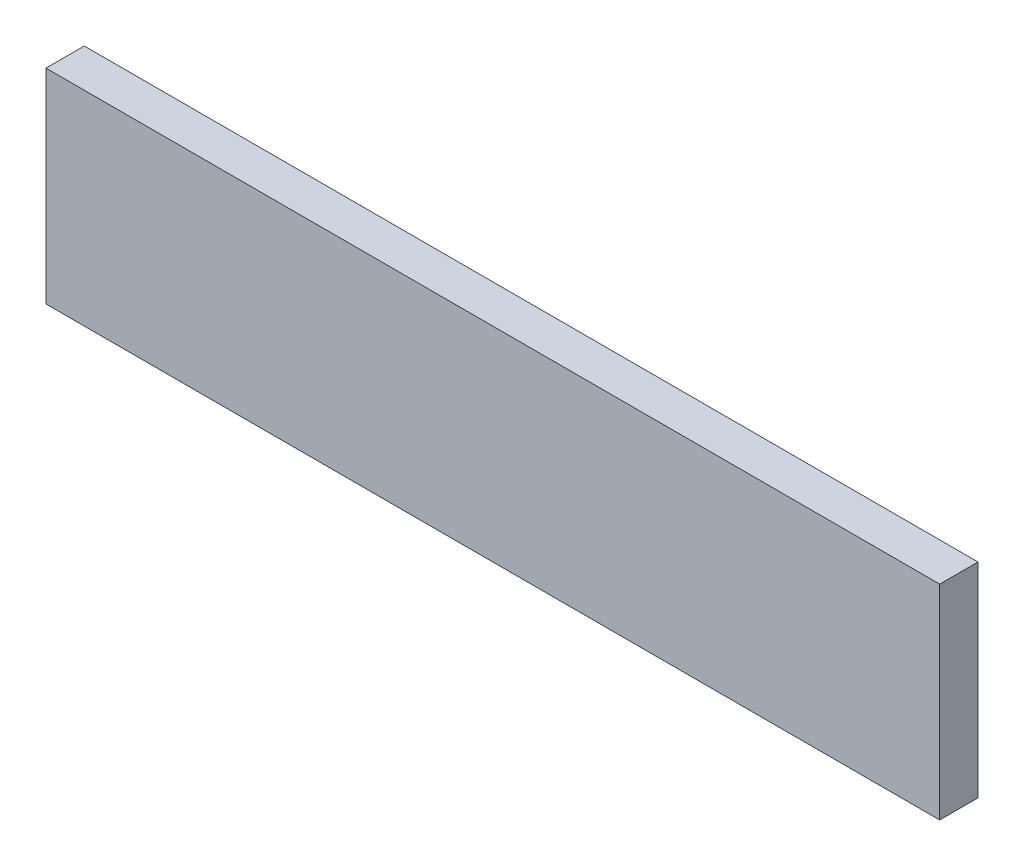
ISO-10303-21;
HEADER;
FILE_DESCRIPTION(('STEP AP214'),'2;1');
FILE_NAME('part.step','',(''),(''),'','','');
FILE_SCHEMA(('AUTOMOTIVE_DESIGN { 1 0 10303 214 1 1 1 1 }'));
ENDSEC;
DATA;
#1=APPLICATION_CONTEXT('core data for automotive mechanical design processes');
#2=APPLICATION_PROTOCOL_DEFINITION('international standard','automotive_design',2000,#1);
#3=PRODUCT_CONTEXT('',#1,'mechanical');
#4=PRODUCT('Part','Part','',(#3));
#5=PRODUCT_RELATED_PRODUCT_CATEGORY('part','',(#4));
#6=PRODUCT_DEFINITION_FORMATION('','',#4);
#7=PRODUCT_DEFINITION_CONTEXT('part definition',#1,'design');
#8=PRODUCT_DEFINITION('design','',#6,#7);
#9=PRODUCT_DEFINITION_SHAPE('','',#8);
#10=(LENGTH_UNIT() NAMED_UNIT(*) SI_UNIT(.MILLI.,.METRE.));
#11=(NAMED_UNIT(*) PLANE_ANGLE_UNIT() SI_UNIT($,.RADIAN.));
#12=(NAMED_UNIT(*) SI_UNIT($,.STERADIAN.) SOLID_ANGLE_UNIT());
#13=UNCERTAINTY_MEASURE_WITH_UNIT(LENGTH_MEASURE(1.E-05),#10,'distance_accuracy_value','');
#14=(GEOMETRIC_REPRESENTATION_CONTEXT(3) GLOBAL_UNCERTAINTY_ASSIGNED_CONTEXT((#13)) GLOBAL_UNIT_ASSIGNED_CONTEXT((#10,
#11,#12)) REPRESENTATION_CONTEXT('',''));
#15=CARTESIAN_POINT('',(0.,0.,0.));
#16=DIRECTION('',(0.,0.,1.));
#17=DIRECTION('',(1.,0.,0.));
#18=AXIS2_PLACEMENT_3D('',#15,#16,#17);
#19=CARTESIAN_POINT('',(0.,0.,-15.));
#20=DIRECTION('',(-1.,0.,0.));
#21=DIRECTION('',(0.,-1.,0.));
#22=AXIS2_PLACEMENT_3D('',#19,#20,#21);
#23=PLANE('',#22);
#24=DIRECTION('',(0.,-1.,0.));
#25=VECTOR('',#24,1.);
#26=CARTESIAN_POINT('',(0.,0.,0.));
#27=LINE('',#26,#25);
#28=CARTESIAN_POINT('',(0.,0.,0.));
#29=VERTEX_POINT('',#28);
#30=CARTESIAN_POINT('',(0.,-80.,0.));
#31=VERTEX_POINT('',#30);
#32=EDGE_CURVE('E102',#29,#31,#27,.T.);
#33=ORIENTED_EDGE('',*,*,#32,.F.);
#34=DIRECTION('',(0.,0.,1.));
#35=VECTOR('',#34,1.);
#36=CARTESIAN_POINT('',(0.,0.,-15.));
#37=LINE('',#36,#35);
#38=CARTESIAN_POINT('',(0.,0.,-15.));
#39=VERTEX_POINT('',#38);
#40=EDGE_CURVE('E11',#39,#29,#37,.T.);
#41=ORIENTED_EDGE('',*,*,#40,.F.);
#42=DIRECTION('',(0.,-1.,0.));
#43=VECTOR('',#42,1.);
#44=CARTESIAN_POINT('',(0.,0.,-15.));
#45=LINE('',#44,#43);
#46=CARTESIAN_POINT('',(0.,-80.,-15.));
#47=VERTEX_POINT('',#46);
#48=EDGE_CURVE('E96',#39,#47,#45,.T.);
#49=ORIENTED_EDGE('',*,*,#48,.T.);
#50=DIRECTION('',(0.,0.,1.));
#51=VECTOR('',#50,1.);
#52=CARTESIAN_POINT('',(0.,-80.,-15.));
#53=LINE('',#52,#51);
#54=EDGE_CURVE('E41',#47,#31,#53,.T.);
#55=ORIENTED_EDGE('',*,*,#54,.T.);
#56=EDGE_LOOP('',(#33,#41,#49,#55));
#57=FACE_BOUND('',#56,.T.);
#58=ADVANCED_FACE('F38',(#57),#23,.T.);
#59=CARTESIAN_POINT('',(0.,0.,-15.));
#60=DIRECTION('',(0.,1.,0.));
#61=DIRECTION('',(0.,0.,1.));
#62=AXIS2_PLACEMENT_3D('',#59,#60,#61);
#63=PLANE('',#62);
#64=DIRECTION('',(-1.,0.,0.));
#65=VECTOR('',#64,1.);
#66=CARTESIAN_POINT('',(0.,0.,0.));
#67=LINE('',#66,#65);
#68=CARTESIAN_POINT('',(350.,0.,0.));
#69=VERTEX_POINT('',#68);
#70=EDGE_CURVE('E98',#69,#29,#67,.T.);
#71=ORIENTED_EDGE('',*,*,#70,.F.);
#72=DIRECTION('',(0.,0.,1.));
#73=VECTOR('',#72,1.);
#74=CARTESIAN_POINT('',(350.,0.,-15.));
#75=LINE('',#74,#73);
#76=CARTESIAN_POINT('',(350.,0.,-15.));
#77=VERTEX_POINT('',#76);
#78=EDGE_CURVE('E47',#77,#69,#75,.T.);
#79=ORIENTED_EDGE('',*,*,#78,.F.);
#80=DIRECTION('',(-1.,0.,0.));
#81=VECTOR('',#80,1.);
#82=CARTESIAN_POINT('',(0.,0.,-15.));
#83=LINE('',#82,#81);
#84=EDGE_CURVE('E93',#77,#39,#83,.T.);
#85=ORIENTED_EDGE('',*,*,#84,.T.);
#86=ORIENTED_EDGE('',*,*,#40,.T.);
#87=EDGE_LOOP('',(#71,#79,#85,#86));
#88=FACE_BOUND('',#87,.T.);
#89=ADVANCED_FACE('F112',(#88),#63,.T.);
#90=CARTESIAN_POINT('',(350.,0.,-15.));
#91=DIRECTION('',(1.,0.,0.));
#92=DIRECTION('',(0.,0.,-1.));
#93=AXIS2_PLACEMENT_3D('',#90,#91,#92);
#94=PLANE('',#93);
#95=DIRECTION('',(0.,1.,0.));
#96=VECTOR('',#95,1.);
#97=CARTESIAN_POINT('',(350.,0.,0.));
#98=LINE('',#97,#96);
#99=CARTESIAN_POINT('',(350.,-80.,0.));
#100=VERTEX_POINT('',#99);
#101=EDGE_CURVE('E88',#100,#69,#98,.T.);
#102=ORIENTED_EDGE('',*,*,#101,.F.);
#103=DIRECTION('',(0.,0.,1.));
#104=VECTOR('',#103,1.);
#105=CARTESIAN_POINT('',(350.,-80.,-15.));
#106=LINE('',#105,#104);
#107=CARTESIAN_POINT('',(350.,-80.,-15.));
#108=VERTEX_POINT('',#107);
#109=EDGE_CURVE('E83',#108,#100,#106,.T.);
#110=ORIENTED_EDGE('',*,*,#109,.F.);
#111=DIRECTION('',(0.,1.,0.));
#112=VECTOR('',#111,1.);
#113=CARTESIAN_POINT('',(350.,0.,-15.));
#114=LINE('',#113,#112);
#115=EDGE_CURVE('E86',#108,#77,#114,.T.);
#116=ORIENTED_EDGE('',*,*,#115,.T.);
#117=ORIENTED_EDGE('',*,*,#78,.T.);
#118=EDGE_LOOP('',(#102,#110,#116,#117));
#119=FACE_BOUND('',#118,.T.);
#120=ADVANCED_FACE('F85',(#119),#94,.T.);
#121=CARTESIAN_POINT('',(0.,-80.,-15.));
#122=DIRECTION('',(0.,-1.,0.));
#123=DIRECTION('',(0.,0.,-1.));
#124=AXIS2_PLACEMENT_3D('',#121,#122,#123);
#125=PLANE('',#124);
#126=DIRECTION('',(1.,0.,0.));
#127=VECTOR('',#126,1.);
#128=CARTESIAN_POINT('',(0.,-80.,0.));
#129=LINE('',#128,#127);
#130=EDGE_CURVE('E105',#31,#100,#129,.T.);
#131=ORIENTED_EDGE('',*,*,#130,.F.);
#132=ORIENTED_EDGE('',*,*,#54,.F.);
#133=DIRECTION('',(1.,0.,0.));
#134=VECTOR('',#133,1.);
#135=CARTESIAN_POINT('',(0.,-80.,-15.));
#136=LINE('',#135,#134);
#137=EDGE_CURVE('E92',#47,#108,#136,.T.);
#138=ORIENTED_EDGE('',*,*,#137,.T.);
#139=ORIENTED_EDGE('',*,*,#109,.T.);
#140=EDGE_LOOP('',(#131,#132,#138,#139));
#141=FACE_BOUND('',#140,.T.);
#142=ADVANCED_FACE('F95',(#141),#125,.T.);
#143=CARTESIAN_POINT('',(0.,0.,-15.));
#144=DIRECTION('',(0.,0.,1.));
#145=DIRECTION('',(1.,0.,0.));
#146=AXIS2_PLACEMENT_3D('',#143,#144,#145);
#147=PLANE('',#146);
#148=ORIENTED_EDGE('',*,*,#48,.F.);
#149=ORIENTED_EDGE('',*,*,#84,.F.);
#150=ORIENTED_EDGE('',*,*,#115,.F.);
#151=ORIENTED_EDGE('',*,*,#137,.F.);
#152=EDGE_LOOP('',(#148,#149,#150,#151));
#153=FACE_BOUND('',#152,.T.);
#154=ADVANCED_FACE('F91',(#153),#147,.F.);
#155=CARTESIAN_POINT('',(0.,0.,0.));
#156=DIRECTION('',(0.,0.,1.));
#157=DIRECTION('',(1.,0.,0.));
#158=AXIS2_PLACEMENT_3D('',#155,#156,#157);
#159=PLANE('',#158);
#160=ORIENTED_EDGE('',*,*,#32,.T.);
#161=ORIENTED_EDGE('',*,*,#130,.T.);
#162=ORIENTED_EDGE('',*,*,#101,.T.);
#163=ORIENTED_EDGE('',*,*,#70,.T.);
#164=EDGE_LOOP('',(#160,#161,#162,#163));
#165=FACE_BOUND('',#164,.T.);
#166=ADVANCED_FACE('F111',(#165),#159,.T.);
#167=CLOSED_SHELL('',(#58,#89,#120,#142,#154,#166));
#168=MANIFOLD_SOLID_BREP('B2',#167);
#169=ADVANCED_BREP_SHAPE_REPRESENTATION('',(#18,#168),#14);
#170=SHAPE_DEFINITION_REPRESENTATION(#9,#169);
ENDSEC;
END-ISO-10303-21;
